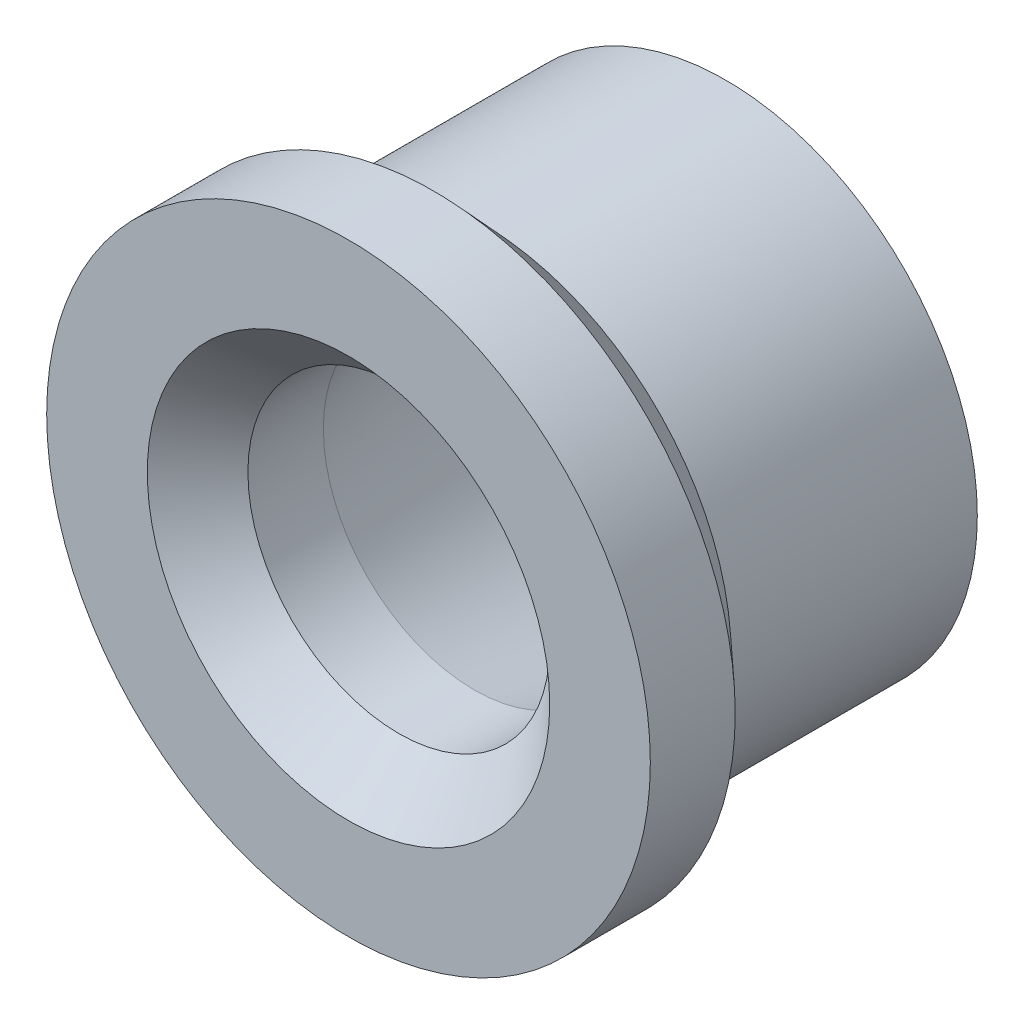
ISO-10303-21;
HEADER;
FILE_DESCRIPTION(('STEP AP214'),'2;1');
FILE_NAME('part.step','',(''),(''),'','','');
FILE_SCHEMA(('AUTOMOTIVE_DESIGN { 1 0 10303 214 1 1 1 1 }'));
ENDSEC;
DATA;
#1=APPLICATION_CONTEXT('core data for automotive mechanical design processes');
#2=APPLICATION_PROTOCOL_DEFINITION('international standard','automotive_design',2000,#1);
#3=PRODUCT_CONTEXT('',#1,'mechanical');
#4=PRODUCT('Part','Part','',(#3));
#5=PRODUCT_RELATED_PRODUCT_CATEGORY('part','',(#4));
#6=PRODUCT_DEFINITION_FORMATION('','',#4);
#7=PRODUCT_DEFINITION_CONTEXT('part definition',#1,'design');
#8=PRODUCT_DEFINITION('design','',#6,#7);
#9=PRODUCT_DEFINITION_SHAPE('','',#8);
#10=(LENGTH_UNIT() NAMED_UNIT(*) SI_UNIT(.MILLI.,.METRE.));
#11=(NAMED_UNIT(*) PLANE_ANGLE_UNIT() SI_UNIT($,.RADIAN.));
#12=(NAMED_UNIT(*) SI_UNIT($,.STERADIAN.) SOLID_ANGLE_UNIT());
#13=UNCERTAINTY_MEASURE_WITH_UNIT(LENGTH_MEASURE(1.E-05),#10,'distance_accuracy_value','');
#14=(GEOMETRIC_REPRESENTATION_CONTEXT(3) GLOBAL_UNCERTAINTY_ASSIGNED_CONTEXT((#13)) GLOBAL_UNIT_ASSIGNED_CONTEXT((#10,
#11,#12)) REPRESENTATION_CONTEXT('',''));
#15=CARTESIAN_POINT('',(0.,0.,0.));
#16=DIRECTION('',(0.,0.,1.));
#17=DIRECTION('',(1.,0.,0.));
#18=AXIS2_PLACEMENT_3D('',#15,#16,#17);
#19=CARTESIAN_POINT('',(0.,0.,1.25));
#20=DIRECTION('',(0.,0.,-1.));
#21=DIRECTION('',(-1.,0.,0.));
#22=AXIS2_PLACEMENT_3D('',#19,#20,#21);
#23=CONICAL_SURFACE('',#22,3.,0.197395559849881);
#24=CARTESIAN_POINT('',(0.,0.,-3.75));
#25=DIRECTION('',(0.,0.,-1.));
#26=DIRECTION('',(-1.,0.,0.));
#27=AXIS2_PLACEMENT_3D('',#24,#25,#26);
#28=CIRCLE('',#27,4.);
#29=CARTESIAN_POINT('',(-4.,0.,-3.75));
#30=VERTEX_POINT('',#29);
#31=EDGE_CURVE('E55',#30,#30,#28,.T.);
#32=ORIENTED_EDGE('',*,*,#31,.T.);
#33=EDGE_LOOP('',(#32));
#34=FACE_BOUND('',#33,.T.);
#35=CARTESIAN_POINT('',(0.,0.,1.25));
#36=DIRECTION('',(0.,0.,-1.));
#37=DIRECTION('',(-1.,0.,0.));
#38=AXIS2_PLACEMENT_3D('',#35,#36,#37);
#39=CIRCLE('',#38,3.);
#40=CARTESIAN_POINT('',(-3.,0.,1.25));
#41=VERTEX_POINT('',#40);
#42=EDGE_CURVE('E78',#41,#41,#39,.T.);
#43=ORIENTED_EDGE('',*,*,#42,.F.);
#44=EDGE_LOOP('',(#43));
#45=FACE_BOUND('',#44,.T.);
#46=ADVANCED_FACE('F41',(#34,#45),#23,.F.);
#47=CARTESIAN_POINT('',(0.,0.,-3.75));
#48=DIRECTION('',(0.,0.,-1.));
#49=DIRECTION('',(-1.,0.,0.));
#50=AXIS2_PLACEMENT_3D('',#47,#48,#49);
#51=PLANE('',#50);
#52=CARTESIAN_POINT('',(0.,0.,-3.75));
#53=DIRECTION('',(0.,0.,-1.));
#54=DIRECTION('',(-1.,0.,0.));
#55=AXIS2_PLACEMENT_3D('',#52,#53,#54);
#56=CIRCLE('',#55,5.);
#57=CARTESIAN_POINT('',(-5.,0.,-3.75));
#58=VERTEX_POINT('',#57);
#59=EDGE_CURVE('E60',#58,#58,#56,.T.);
#60=ORIENTED_EDGE('',*,*,#59,.T.);
#61=EDGE_LOOP('',(#60));
#62=FACE_BOUND('',#61,.T.);
#63=ORIENTED_EDGE('',*,*,#31,.F.);
#64=EDGE_LOOP('',(#63));
#65=FACE_BOUND('',#64,.T.);
#66=ADVANCED_FACE('F86',(#62,#65),#51,.T.);
#67=CARTESIAN_POINT('',(0.,0.,-3.75));
#68=DIRECTION('',(0.,0.,-1.));
#69=DIRECTION('',(-1.,0.,0.));
#70=AXIS2_PLACEMENT_3D('',#67,#68,#69);
#71=CYLINDRICAL_SURFACE('',#70,5.);
#72=CARTESIAN_POINT('',(0.,0.,1.14051094890511));
#73=DIRECTION('',(0.,0.,-1.));
#74=DIRECTION('',(-1.,0.,0.));
#75=AXIS2_PLACEMENT_3D('',#72,#73,#74);
#76=CIRCLE('',#75,5.);
#77=CARTESIAN_POINT('',(-5.,0.,1.14051094890511));
#78=VERTEX_POINT('',#77);
#79=EDGE_CURVE('E66',#78,#78,#76,.T.);
#80=ORIENTED_EDGE('',*,*,#79,.T.);
#81=EDGE_LOOP('',(#80));
#82=FACE_BOUND('',#81,.T.);
#83=ORIENTED_EDGE('',*,*,#59,.F.);
#84=EDGE_LOOP('',(#83));
#85=FACE_BOUND('',#84,.T.);
#86=ADVANCED_FACE('F91',(#82,#85),#71,.T.);
#87=CARTESIAN_POINT('',(0.,0.,1.14051094890511));
#88=DIRECTION('',(0.,0.,1.));
#89=DIRECTION('',(1.,0.,0.));
#90=AXIS2_PLACEMENT_3D('',#87,#88,#89);
#91=CONICAL_SURFACE('',#90,5.,0.826100541927076);
#92=CARTESIAN_POINT('',(0.,0.,2.06224843864934));
#93=DIRECTION('',(0.,0.,-1.));
#94=DIRECTION('',(-1.,0.,0.));
#95=AXIS2_PLACEMENT_3D('',#92,#93,#94);
#96=CIRCLE('',#95,6.);
#97=CARTESIAN_POINT('',(-6.,0.,2.06224843864934));
#98=VERTEX_POINT('',#97);
#99=EDGE_CURVE('E70',#98,#98,#96,.T.);
#100=ORIENTED_EDGE('',*,*,#99,.T.);
#101=EDGE_LOOP('',(#100));
#102=FACE_BOUND('',#101,.T.);
#103=ORIENTED_EDGE('',*,*,#79,.F.);
#104=EDGE_LOOP('',(#103));
#105=FACE_BOUND('',#104,.T.);
#106=ADVANCED_FACE('F97',(#102,#105),#91,.T.);
#107=CARTESIAN_POINT('',(0.,0.,-3.75));
#108=DIRECTION('',(0.,0.,-1.));
#109=DIRECTION('',(-1.,0.,0.));
#110=AXIS2_PLACEMENT_3D('',#107,#108,#109);
#111=CYLINDRICAL_SURFACE('',#110,6.);
#112=CARTESIAN_POINT('',(0.,0.,3.75));
#113=DIRECTION('',(0.,0.,-1.));
#114=DIRECTION('',(-1.,0.,0.));
#115=AXIS2_PLACEMENT_3D('',#112,#113,#114);
#116=CIRCLE('',#115,6.);
#117=CARTESIAN_POINT('',(-6.,0.,3.75));
#118=VERTEX_POINT('',#117);
#119=EDGE_CURVE('E74',#118,#118,#116,.T.);
#120=ORIENTED_EDGE('',*,*,#119,.T.);
#121=EDGE_LOOP('',(#120));
#122=FACE_BOUND('',#121,.T.);
#123=ORIENTED_EDGE('',*,*,#99,.F.);
#124=EDGE_LOOP('',(#123));
#125=FACE_BOUND('',#124,.T.);
#126=ADVANCED_FACE('F101',(#122,#125),#111,.T.);
#127=CARTESIAN_POINT('',(0.,0.,3.75));
#128=DIRECTION('',(0.,0.,1.));
#129=DIRECTION('',(1.,0.,0.));
#130=AXIS2_PLACEMENT_3D('',#127,#128,#129);
#131=PLANE('',#130);
#132=CARTESIAN_POINT('',(0.,0.,3.75));
#133=DIRECTION('',(0.,0.,1.));
#134=DIRECTION('',(1.,0.,0.));
#135=AXIS2_PLACEMENT_3D('',#132,#133,#134);
#136=CIRCLE('',#135,4.00000000000001);
#137=CARTESIAN_POINT('',(4.00000000000001,0.,3.75));
#138=VERTEX_POINT('',#137);
#139=EDGE_CURVE('E10',#138,#138,#136,.F.);
#140=ORIENTED_EDGE('',*,*,#139,.T.);
#141=EDGE_LOOP('',(#140));
#142=FACE_BOUND('',#141,.T.);
#143=ORIENTED_EDGE('',*,*,#119,.F.);
#144=EDGE_LOOP('',(#143));
#145=FACE_BOUND('',#144,.T.);
#146=ADVANCED_FACE('F105',(#142,#145),#131,.T.);
#147=CARTESIAN_POINT('',(0.,0.,-6.25));
#148=DIRECTION('',(0.,0.,1.));
#149=DIRECTION('',(1.,0.,0.));
#150=AXIS2_PLACEMENT_3D('',#147,#148,#149);
#151=CYLINDRICAL_SURFACE('',#150,3.);
#152=CARTESIAN_POINT('',(0.,0.,2.75));
#153=DIRECTION('',(0.,0.,1.));
#154=DIRECTION('',(1.,0.,0.));
#155=AXIS2_PLACEMENT_3D('',#152,#153,#154);
#156=CIRCLE('',#155,3.);
#157=CARTESIAN_POINT('',(3.,0.,2.75));
#158=VERTEX_POINT('',#157);
#159=EDGE_CURVE('E50',#158,#158,#156,.T.);
#160=ORIENTED_EDGE('',*,*,#159,.T.);
#161=EDGE_LOOP('',(#160));
#162=FACE_BOUND('',#161,.T.);
#163=ORIENTED_EDGE('',*,*,#42,.T.);
#164=EDGE_LOOP('',(#163));
#165=FACE_BOUND('',#164,.T.);
#166=ADVANCED_FACE('F83',(#162,#165),#151,.F.);
#167=CARTESIAN_POINT('',(0.,0.,2.75));
#168=DIRECTION('',(0.,0.,1.));
#169=DIRECTION('',(1.,0.,0.));
#170=AXIS2_PLACEMENT_3D('',#167,#168,#169);
#171=CONICAL_SURFACE('',#170,3.,0.785398163397452);
#172=ORIENTED_EDGE('',*,*,#139,.F.);
#173=EDGE_LOOP('',(#172));
#174=FACE_BOUND('',#173,.T.);
#175=ORIENTED_EDGE('',*,*,#159,.F.);
#176=EDGE_LOOP('',(#175));
#177=FACE_BOUND('',#176,.T.);
#178=ADVANCED_FACE('F44',(#174,#177),#171,.F.);
#179=CLOSED_SHELL('',(#46,#66,#86,#106,#126,#146,#166,#178));
#180=MANIFOLD_SOLID_BREP('B2',#179);
#181=ADVANCED_BREP_SHAPE_REPRESENTATION('',(#18,#180),#14);
#182=SHAPE_DEFINITION_REPRESENTATION(#9,#181);
ENDSEC;
END-ISO-10303-21;
